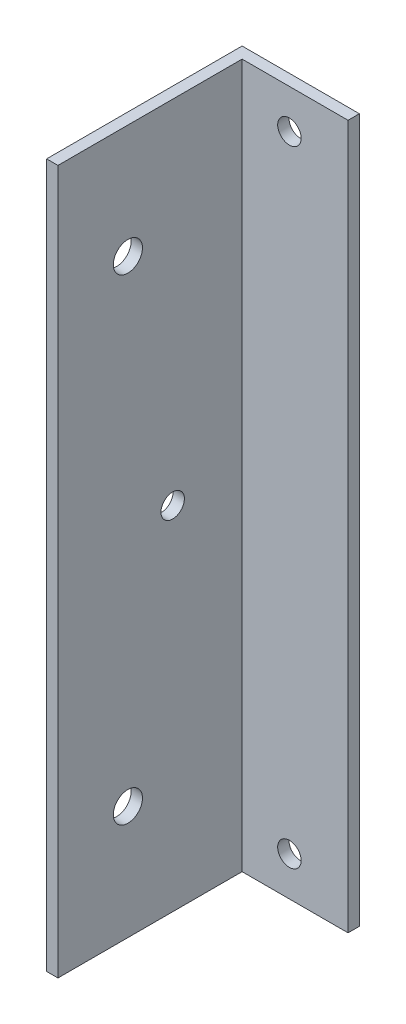
ISO-10303-21;
HEADER;
FILE_DESCRIPTION(('STEP AP214'),'2;1');
FILE_NAME('part.step','',(''),(''),'','','');
FILE_SCHEMA(('AUTOMOTIVE_DESIGN { 1 0 10303 214 1 1 1 1 }'));
ENDSEC;
DATA;
#1=APPLICATION_CONTEXT('core data for automotive mechanical design processes');
#2=APPLICATION_PROTOCOL_DEFINITION('international standard','automotive_design',2000,#1);
#3=PRODUCT_CONTEXT('',#1,'mechanical');
#4=PRODUCT('Part','Part','',(#3));
#5=PRODUCT_RELATED_PRODUCT_CATEGORY('part','',(#4));
#6=PRODUCT_DEFINITION_FORMATION('','',#4);
#7=PRODUCT_DEFINITION_CONTEXT('part definition',#1,'design');
#8=PRODUCT_DEFINITION('design','',#6,#7);
#9=PRODUCT_DEFINITION_SHAPE('','',#8);
#10=(LENGTH_UNIT() NAMED_UNIT(*) SI_UNIT(.MILLI.,.METRE.));
#11=(NAMED_UNIT(*) PLANE_ANGLE_UNIT() SI_UNIT($,.RADIAN.));
#12=(NAMED_UNIT(*) SI_UNIT($,.STERADIAN.) SOLID_ANGLE_UNIT());
#13=UNCERTAINTY_MEASURE_WITH_UNIT(LENGTH_MEASURE(1.E-05),#10,'distance_accuracy_value','');
#14=(GEOMETRIC_REPRESENTATION_CONTEXT(3) GLOBAL_UNCERTAINTY_ASSIGNED_CONTEXT((#13)) GLOBAL_UNIT_ASSIGNED_CONTEXT((#10,
#11,#12)) REPRESENTATION_CONTEXT('',''));
#15=CARTESIAN_POINT('',(0.,0.,0.));
#16=DIRECTION('',(0.,0.,1.));
#17=DIRECTION('',(1.,0.,0.));
#18=AXIS2_PLACEMENT_3D('',#15,#16,#17);
#19=CARTESIAN_POINT('',(7.49999999999999,45.,1.45));
#20=DIRECTION('',(-1.,0.,0.));
#21=DIRECTION('',(0.,-1.,0.));
#22=AXIS2_PLACEMENT_3D('',#19,#20,#21);
#23=PLANE('',#22);
#24=DIRECTION('',(0.,1.,0.));
#25=VECTOR('',#24,1.);
#26=CARTESIAN_POINT('',(7.49999999999999,45.,0.));
#27=LINE('',#26,#25);
#28=CARTESIAN_POINT('',(7.5,-45.,0.));
#29=VERTEX_POINT('',#28);
#30=CARTESIAN_POINT('',(7.49999999999999,45.,0.));
#31=VERTEX_POINT('',#30);
#32=EDGE_CURVE('E96',#29,#31,#27,.T.);
#33=ORIENTED_EDGE('',*,*,#32,.T.);
#34=DIRECTION('',(0.,0.,-1.));
#35=VECTOR('',#34,1.);
#36=CARTESIAN_POINT('',(7.49999999999999,45.,1.45));
#37=LINE('',#36,#35);
#38=CARTESIAN_POINT('',(7.49999999999999,45.,1.45));
#39=VERTEX_POINT('',#38);
#40=EDGE_CURVE('E11',#39,#31,#37,.T.);
#41=ORIENTED_EDGE('',*,*,#40,.F.);
#42=DIRECTION('',(0.,1.,0.));
#43=VECTOR('',#42,1.);
#44=CARTESIAN_POINT('',(7.49999999999999,45.,1.45));
#45=LINE('',#44,#43);
#46=CARTESIAN_POINT('',(7.5,-45.,1.45));
#47=VERTEX_POINT('',#46);
#48=EDGE_CURVE('E90',#47,#39,#45,.T.);
#49=ORIENTED_EDGE('',*,*,#48,.F.);
#50=DIRECTION('',(0.,0.,-1.));
#51=VECTOR('',#50,1.);
#52=CARTESIAN_POINT('',(7.5,-45.,1.45));
#53=LINE('',#52,#51);
#54=EDGE_CURVE('E81',#47,#29,#53,.T.);
#55=ORIENTED_EDGE('',*,*,#54,.T.);
#56=EDGE_LOOP('',(#33,#41,#49,#55));
#57=FACE_BOUND('',#56,.T.);
#58=ADVANCED_FACE('F38',(#57),#23,.F.);
#59=CARTESIAN_POINT('',(-7.50000000000001,45.,1.45));
#60=DIRECTION('',(0.,-1.,0.));
#61=DIRECTION('',(0.,0.,-1.));
#62=AXIS2_PLACEMENT_3D('',#59,#60,#61);
#63=PLANE('',#62);
#64=DIRECTION('',(-1.,0.,0.));
#65=VECTOR('',#64,1.);
#66=CARTESIAN_POINT('',(-7.50000000000001,45.,0.));
#67=LINE('',#66,#65);
#68=CARTESIAN_POINT('',(-7.50000000000001,45.,0.));
#69=VERTEX_POINT('',#68);
#70=EDGE_CURVE('E100',#31,#69,#67,.T.);
#71=ORIENTED_EDGE('',*,*,#70,.T.);
#72=DIRECTION('',(0.,0.,-1.));
#73=VECTOR('',#72,1.);
#74=CARTESIAN_POINT('',(-7.50000000000001,45.,1.45));
#75=LINE('',#74,#73);
#76=CARTESIAN_POINT('',(-7.50000000000001,45.,25.));
#77=VERTEX_POINT('',#76);
#78=EDGE_CURVE('E46',#77,#69,#75,.T.);
#79=ORIENTED_EDGE('',*,*,#78,.F.);
#80=DIRECTION('',(-1.,0.,0.));
#81=VECTOR('',#80,1.);
#82=CARTESIAN_POINT('',(-7.50000000000001,45.,25.));
#83=LINE('',#82,#81);
#84=CARTESIAN_POINT('',(-6.05000000000001,45.,25.));
#85=VERTEX_POINT('',#84);
#86=EDGE_CURVE('E130',#85,#77,#83,.T.);
#87=ORIENTED_EDGE('',*,*,#86,.F.);
#88=DIRECTION('',(0.,0.,-1.));
#89=VECTOR('',#88,1.);
#90=CARTESIAN_POINT('',(-6.05000000000001,45.,25.));
#91=LINE('',#90,#89);
#92=CARTESIAN_POINT('',(-6.05000000000001,45.,1.45));
#93=VERTEX_POINT('',#92);
#94=EDGE_CURVE('E108',#85,#93,#91,.T.);
#95=ORIENTED_EDGE('',*,*,#94,.T.);
#96=DIRECTION('',(-1.,0.,0.));
#97=VECTOR('',#96,1.);
#98=CARTESIAN_POINT('',(-7.50000000000001,45.,1.45));
#99=LINE('',#98,#97);
#100=EDGE_CURVE('E153',#39,#93,#99,.T.);
#101=ORIENTED_EDGE('',*,*,#100,.F.);
#102=ORIENTED_EDGE('',*,*,#40,.T.);
#103=EDGE_LOOP('',(#71,#79,#87,#95,#101,#102));
#104=FACE_BOUND('',#103,.T.);
#105=ADVANCED_FACE('F127',(#104),#63,.F.);
#106=CARTESIAN_POINT('',(-7.50000000000001,45.,1.45));
#107=DIRECTION('',(1.,0.,0.));
#108=DIRECTION('',(0.,1.,0.));
#109=AXIS2_PLACEMENT_3D('',#106,#107,#108);
#110=PLANE('',#109);
#111=CARTESIAN_POINT('',(-7.5,0.,10.33));
#112=DIRECTION('',(-1.,0.,0.));
#113=DIRECTION('',(0.,-1.,0.));
#114=AXIS2_PLACEMENT_3D('',#111,#112,#113);
#115=CIRCLE('',#114,1.5);
#116=CARTESIAN_POINT('',(-7.5,-1.5,10.33));
#117=VERTEX_POINT('',#116);
#118=EDGE_CURVE('E204',#117,#117,#115,.T.);
#119=ORIENTED_EDGE('',*,*,#118,.F.);
#120=EDGE_LOOP('',(#119));
#121=FACE_BOUND('',#120,.T.);
#122=CARTESIAN_POINT('',(-7.49999999999999,30.462,16.057));
#123=DIRECTION('',(1.,0.,0.));
#124=DIRECTION('',(0.,1.,0.));
#125=AXIS2_PLACEMENT_3D('',#122,#123,#124);
#126=CIRCLE('',#125,1.865);
#127=CARTESIAN_POINT('',(-7.49999999999999,32.327,16.057));
#128=VERTEX_POINT('',#127);
#129=EDGE_CURVE('E192',#128,#128,#126,.T.);
#130=ORIENTED_EDGE('',*,*,#129,.T.);
#131=EDGE_LOOP('',(#130));
#132=FACE_BOUND('',#131,.T.);
#133=CARTESIAN_POINT('',(-7.49999999999999,-30.462,16.057));
#134=DIRECTION('',(-1.,0.,0.));
#135=DIRECTION('',(0.,-1.,0.));
#136=AXIS2_PLACEMENT_3D('',#133,#134,#135);
#137=CIRCLE('',#136,1.865);
#138=CARTESIAN_POINT('',(-7.49999999999999,-32.327,16.057));
#139=VERTEX_POINT('',#138);
#140=EDGE_CURVE('E188',#139,#139,#137,.T.);
#141=ORIENTED_EDGE('',*,*,#140,.F.);
#142=EDGE_LOOP('',(#141));
#143=FACE_BOUND('',#142,.T.);
#144=DIRECTION('',(0.,-1.,0.));
#145=VECTOR('',#144,1.);
#146=CARTESIAN_POINT('',(-7.50000000000001,45.,0.));
#147=LINE('',#146,#145);
#148=CARTESIAN_POINT('',(-7.49999999999999,-45.,0.));
#149=VERTEX_POINT('',#148);
#150=EDGE_CURVE('E91',#69,#149,#147,.T.);
#151=ORIENTED_EDGE('',*,*,#150,.T.);
#152=DIRECTION('',(0.,0.,-1.));
#153=VECTOR('',#152,1.);
#154=CARTESIAN_POINT('',(-7.49999999999999,-45.,1.45));
#155=LINE('',#154,#153);
#156=CARTESIAN_POINT('',(-7.50000000000001,-45.,25.));
#157=VERTEX_POINT('',#156);
#158=EDGE_CURVE('E85',#157,#149,#155,.T.);
#159=ORIENTED_EDGE('',*,*,#158,.F.);
#160=DIRECTION('',(0.,-1.,0.));
#161=VECTOR('',#160,1.);
#162=CARTESIAN_POINT('',(-7.50000000000001,45.,25.));
#163=LINE('',#162,#161);
#164=EDGE_CURVE('E123',#77,#157,#163,.T.);
#165=ORIENTED_EDGE('',*,*,#164,.F.);
#166=ORIENTED_EDGE('',*,*,#78,.T.);
#167=EDGE_LOOP('',(#151,#159,#165,#166));
#168=FACE_BOUND('',#167,.T.);
#169=ADVANCED_FACE('F121',(#121,#132,#143,#168),#110,.F.);
#170=CARTESIAN_POINT('',(-7.49999999999999,-45.,1.45));
#171=DIRECTION('',(0.,1.,0.));
#172=DIRECTION('',(0.,0.,1.));
#173=AXIS2_PLACEMENT_3D('',#170,#171,#172);
#174=PLANE('',#173);
#175=DIRECTION('',(1.,0.,0.));
#176=VECTOR('',#175,1.);
#177=CARTESIAN_POINT('',(-7.49999999999999,-45.,0.));
#178=LINE('',#177,#176);
#179=EDGE_CURVE('E78',#149,#29,#178,.T.);
#180=ORIENTED_EDGE('',*,*,#179,.T.);
#181=ORIENTED_EDGE('',*,*,#54,.F.);
#182=DIRECTION('',(1.,0.,0.));
#183=VECTOR('',#182,1.);
#184=CARTESIAN_POINT('',(-7.49999999999999,-45.,1.45));
#185=LINE('',#184,#183);
#186=CARTESIAN_POINT('',(-6.05,-45.,1.45));
#187=VERTEX_POINT('',#186);
#188=EDGE_CURVE('E58',#187,#47,#185,.T.);
#189=ORIENTED_EDGE('',*,*,#188,.F.);
#190=DIRECTION('',(0.,0.,-1.));
#191=VECTOR('',#190,1.);
#192=CARTESIAN_POINT('',(-6.04999999999999,-45.,25.));
#193=LINE('',#192,#191);
#194=CARTESIAN_POINT('',(-6.04999999999999,-45.,25.));
#195=VERTEX_POINT('',#194);
#196=EDGE_CURVE('E102',#195,#187,#193,.T.);
#197=ORIENTED_EDGE('',*,*,#196,.F.);
#198=DIRECTION('',(1.,0.,0.));
#199=VECTOR('',#198,1.);
#200=CARTESIAN_POINT('',(-7.50000000000001,-45.,25.));
#201=LINE('',#200,#199);
#202=EDGE_CURVE('E145',#157,#195,#201,.T.);
#203=ORIENTED_EDGE('',*,*,#202,.F.);
#204=ORIENTED_EDGE('',*,*,#158,.T.);
#205=EDGE_LOOP('',(#180,#181,#189,#197,#203,#204));
#206=FACE_BOUND('',#205,.T.);
#207=ADVANCED_FACE('F80',(#206),#174,.F.);
#208=CARTESIAN_POINT('',(0.,0.,1.45));
#209=DIRECTION('',(0.,0.,1.));
#210=DIRECTION('',(1.,0.,0.));
#211=AXIS2_PLACEMENT_3D('',#208,#209,#210);
#212=PLANE('',#211);
#213=CARTESIAN_POINT('',(0.,40.,1.45));
#214=DIRECTION('',(0.,0.,1.));
#215=DIRECTION('',(1.,0.,0.));
#216=AXIS2_PLACEMENT_3D('',#213,#214,#215);
#217=CIRCLE('',#216,1.5);
#218=CARTESIAN_POINT('',(1.5,40.,1.45));
#219=VERTEX_POINT('',#218);
#220=EDGE_CURVE('E150',#219,#219,#217,.T.);
#221=ORIENTED_EDGE('',*,*,#220,.F.);
#222=EDGE_LOOP('',(#221));
#223=FACE_BOUND('',#222,.T.);
#224=CARTESIAN_POINT('',(0.,-40.,1.45));
#225=DIRECTION('',(0.,0.,1.));
#226=DIRECTION('',(1.,0.,0.));
#227=AXIS2_PLACEMENT_3D('',#224,#225,#226);
#228=CIRCLE('',#227,1.5);
#229=CARTESIAN_POINT('',(1.5,-40.,1.45));
#230=VERTEX_POINT('',#229);
#231=EDGE_CURVE('E172',#230,#230,#228,.T.);
#232=ORIENTED_EDGE('',*,*,#231,.F.);
#233=EDGE_LOOP('',(#232));
#234=FACE_BOUND('',#233,.T.);
#235=DIRECTION('',(0.,1.,0.));
#236=VECTOR('',#235,1.);
#237=CARTESIAN_POINT('',(-6.05000000000001,45.,1.45));
#238=LINE('',#237,#236);
#239=EDGE_CURVE('E53',#187,#93,#238,.T.);
#240=ORIENTED_EDGE('',*,*,#239,.F.);
#241=ORIENTED_EDGE('',*,*,#188,.T.);
#242=ORIENTED_EDGE('',*,*,#48,.T.);
#243=ORIENTED_EDGE('',*,*,#100,.T.);
#244=EDGE_LOOP('',(#240,#241,#242,#243));
#245=FACE_BOUND('',#244,.T.);
#246=ADVANCED_FACE('F157',(#223,#234,#245),#212,.T.);
#247=CARTESIAN_POINT('',(0.,0.,0.));
#248=DIRECTION('',(0.,0.,1.));
#249=DIRECTION('',(1.,0.,0.));
#250=AXIS2_PLACEMENT_3D('',#247,#248,#249);
#251=PLANE('',#250);
#252=CARTESIAN_POINT('',(0.,40.,0.));
#253=DIRECTION('',(0.,0.,-1.));
#254=DIRECTION('',(-1.,0.,0.));
#255=AXIS2_PLACEMENT_3D('',#252,#253,#254);
#256=CIRCLE('',#255,1.5);
#257=CARTESIAN_POINT('',(-1.5,40.,0.));
#258=VERTEX_POINT('',#257);
#259=EDGE_CURVE('E176',#258,#258,#256,.T.);
#260=ORIENTED_EDGE('',*,*,#259,.F.);
#261=EDGE_LOOP('',(#260));
#262=FACE_BOUND('',#261,.T.);
#263=CARTESIAN_POINT('',(0.,-40.,0.));
#264=DIRECTION('',(0.,0.,-1.));
#265=DIRECTION('',(-1.,0.,0.));
#266=AXIS2_PLACEMENT_3D('',#263,#264,#265);
#267=CIRCLE('',#266,1.5);
#268=CARTESIAN_POINT('',(-1.5,-40.,0.));
#269=VERTEX_POINT('',#268);
#270=EDGE_CURVE('E177',#269,#269,#267,.T.);
#271=ORIENTED_EDGE('',*,*,#270,.F.);
#272=EDGE_LOOP('',(#271));
#273=FACE_BOUND('',#272,.T.);
#274=ORIENTED_EDGE('',*,*,#32,.F.);
#275=ORIENTED_EDGE('',*,*,#179,.F.);
#276=ORIENTED_EDGE('',*,*,#150,.F.);
#277=ORIENTED_EDGE('',*,*,#70,.F.);
#278=EDGE_LOOP('',(#274,#275,#276,#277));
#279=FACE_BOUND('',#278,.T.);
#280=ADVANCED_FACE('F99',(#262,#273,#279),#251,.F.);
#281=CARTESIAN_POINT('',(-6.05000000000001,45.,25.));
#282=DIRECTION('',(-1.,0.,0.));
#283=DIRECTION('',(0.,-1.,0.));
#284=AXIS2_PLACEMENT_3D('',#281,#282,#283);
#285=PLANE('',#284);
#286=CARTESIAN_POINT('',(-6.05,0.,10.33));
#287=DIRECTION('',(-1.,0.,0.));
#288=DIRECTION('',(0.,-1.,0.));
#289=AXIS2_PLACEMENT_3D('',#286,#287,#288);
#290=CIRCLE('',#289,1.5);
#291=CARTESIAN_POINT('',(-6.05,-1.5,10.33));
#292=VERTEX_POINT('',#291);
#293=EDGE_CURVE('E197',#292,#292,#290,.F.);
#294=ORIENTED_EDGE('',*,*,#293,.F.);
#295=EDGE_LOOP('',(#294));
#296=FACE_BOUND('',#295,.T.);
#297=CARTESIAN_POINT('',(-6.05,30.462,16.057));
#298=DIRECTION('',(-1.,0.,0.));
#299=DIRECTION('',(0.,-1.,0.));
#300=AXIS2_PLACEMENT_3D('',#297,#298,#299);
#301=CIRCLE('',#300,1.865);
#302=CARTESIAN_POINT('',(-6.05,28.597,16.057));
#303=VERTEX_POINT('',#302);
#304=EDGE_CURVE('E193',#303,#303,#301,.T.);
#305=ORIENTED_EDGE('',*,*,#304,.T.);
#306=EDGE_LOOP('',(#305));
#307=FACE_BOUND('',#306,.T.);
#308=CARTESIAN_POINT('',(-6.05,-30.462,16.057));
#309=DIRECTION('',(-1.,0.,0.));
#310=DIRECTION('',(0.,-1.,0.));
#311=AXIS2_PLACEMENT_3D('',#308,#309,#310);
#312=CIRCLE('',#311,1.865);
#313=CARTESIAN_POINT('',(-6.05,-32.327,16.057));
#314=VERTEX_POINT('',#313);
#315=EDGE_CURVE('E181',#314,#314,#312,.F.);
#316=ORIENTED_EDGE('',*,*,#315,.F.);
#317=EDGE_LOOP('',(#316));
#318=FACE_BOUND('',#317,.T.);
#319=ORIENTED_EDGE('',*,*,#239,.T.);
#320=ORIENTED_EDGE('',*,*,#94,.F.);
#321=DIRECTION('',(0.,1.,0.));
#322=VECTOR('',#321,1.);
#323=CARTESIAN_POINT('',(-6.05000000000001,45.,25.));
#324=LINE('',#323,#322);
#325=EDGE_CURVE('E138',#195,#85,#324,.T.);
#326=ORIENTED_EDGE('',*,*,#325,.F.);
#327=ORIENTED_EDGE('',*,*,#196,.T.);
#328=EDGE_LOOP('',(#319,#320,#326,#327));
#329=FACE_BOUND('',#328,.T.);
#330=ADVANCED_FACE('F159',(#296,#307,#318,#329),#285,.F.);
#331=CARTESIAN_POINT('',(0.,0.,25.));
#332=DIRECTION('',(0.,0.,1.));
#333=DIRECTION('',(1.,0.,0.));
#334=AXIS2_PLACEMENT_3D('',#331,#332,#333);
#335=PLANE('',#334);
#336=ORIENTED_EDGE('',*,*,#164,.T.);
#337=ORIENTED_EDGE('',*,*,#202,.T.);
#338=ORIENTED_EDGE('',*,*,#325,.T.);
#339=ORIENTED_EDGE('',*,*,#86,.T.);
#340=EDGE_LOOP('',(#336,#337,#338,#339));
#341=FACE_BOUND('',#340,.T.);
#342=ADVANCED_FACE('F134',(#341),#335,.T.);
#343=CARTESIAN_POINT('',(0.,-40.,25.));
#344=DIRECTION('',(0.,0.,-1.));
#345=DIRECTION('',(-1.,0.,0.));
#346=AXIS2_PLACEMENT_3D('',#343,#344,#345);
#347=CYLINDRICAL_SURFACE('',#346,1.5);
#348=ORIENTED_EDGE('',*,*,#231,.T.);
#349=EDGE_LOOP('',(#348));
#350=FACE_BOUND('',#349,.T.);
#351=ORIENTED_EDGE('',*,*,#270,.T.);
#352=EDGE_LOOP('',(#351));
#353=FACE_BOUND('',#352,.T.);
#354=ADVANCED_FACE('F234',(#350,#353),#347,.F.);
#355=CARTESIAN_POINT('',(0.,40.,25.));
#356=DIRECTION('',(0.,0.,-1.));
#357=DIRECTION('',(-1.,0.,0.));
#358=AXIS2_PLACEMENT_3D('',#355,#356,#357);
#359=CYLINDRICAL_SURFACE('',#358,1.5);
#360=ORIENTED_EDGE('',*,*,#220,.T.);
#361=EDGE_LOOP('',(#360));
#362=FACE_BOUND('',#361,.T.);
#363=ORIENTED_EDGE('',*,*,#259,.T.);
#364=EDGE_LOOP('',(#363));
#365=FACE_BOUND('',#364,.T.);
#366=ADVANCED_FACE('F223',(#362,#365),#359,.F.);
#367=CARTESIAN_POINT('',(7.50100000000001,-30.462,16.057));
#368=DIRECTION('',(-1.,0.,0.));
#369=DIRECTION('',(0.,-1.,0.));
#370=AXIS2_PLACEMENT_3D('',#367,#368,#369);
#371=CYLINDRICAL_SURFACE('',#370,1.865);
#372=ORIENTED_EDGE('',*,*,#140,.T.);
#373=EDGE_LOOP('',(#372));
#374=FACE_BOUND('',#373,.T.);
#375=ORIENTED_EDGE('',*,*,#315,.T.);
#376=EDGE_LOOP('',(#375));
#377=FACE_BOUND('',#376,.T.);
#378=ADVANCED_FACE('F219',(#374,#377),#371,.F.);
#379=CARTESIAN_POINT('',(7.50100000000001,30.462,16.057));
#380=DIRECTION('',(-1.,0.,0.));
#381=DIRECTION('',(0.,-1.,0.));
#382=AXIS2_PLACEMENT_3D('',#379,#380,#381);
#383=CYLINDRICAL_SURFACE('',#382,1.865);
#384=ORIENTED_EDGE('',*,*,#129,.F.);
#385=EDGE_LOOP('',(#384));
#386=FACE_BOUND('',#385,.T.);
#387=ORIENTED_EDGE('',*,*,#304,.F.);
#388=EDGE_LOOP('',(#387));
#389=FACE_BOUND('',#388,.T.);
#390=ADVANCED_FACE('F222',(#386,#389),#383,.F.);
#391=CARTESIAN_POINT('',(7.50100000000001,0.,10.33));
#392=DIRECTION('',(-1.,0.,0.));
#393=DIRECTION('',(0.,-1.,0.));
#394=AXIS2_PLACEMENT_3D('',#391,#392,#393);
#395=CYLINDRICAL_SURFACE('',#394,1.5);
#396=ORIENTED_EDGE('',*,*,#118,.T.);
#397=EDGE_LOOP('',(#396));
#398=FACE_BOUND('',#397,.T.);
#399=ORIENTED_EDGE('',*,*,#293,.T.);
#400=EDGE_LOOP('',(#399));
#401=FACE_BOUND('',#400,.T.);
#402=ADVANCED_FACE('F209',(#398,#401),#395,.F.);
#403=CLOSED_SHELL('',(#58,#105,#169,#207,#246,#280,#330,#342,#354,#366,#378,#390,#402));
#404=MANIFOLD_SOLID_BREP('B2',#403);
#405=ADVANCED_BREP_SHAPE_REPRESENTATION('',(#18,#404),#14);
#406=SHAPE_DEFINITION_REPRESENTATION(#9,#405);
ENDSEC;
END-ISO-10303-21;
